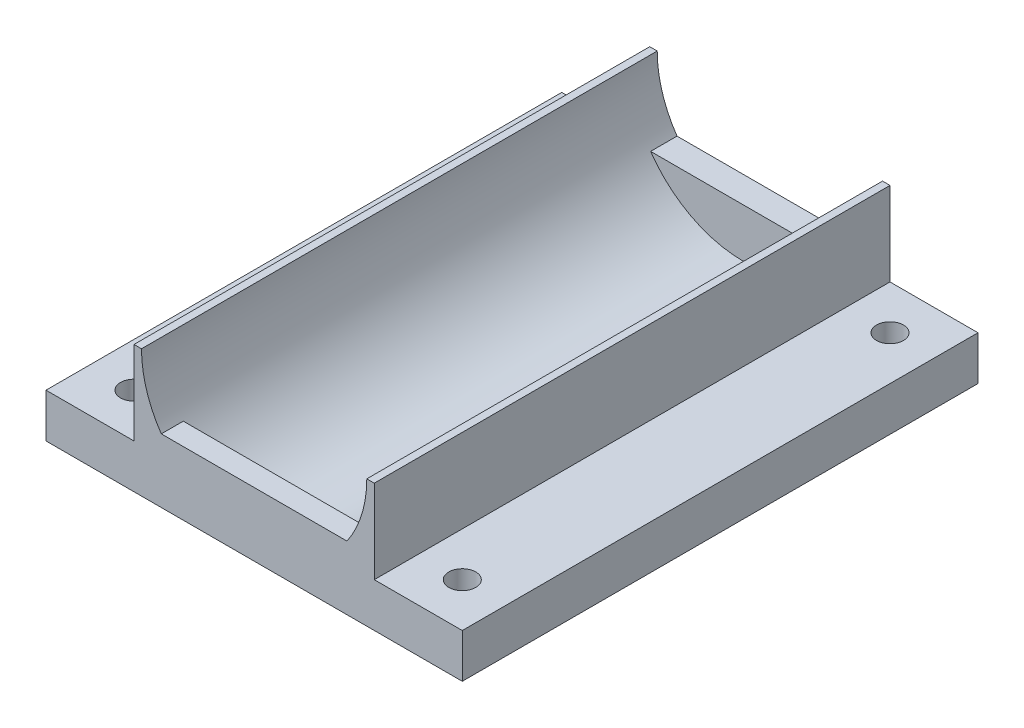
ISO-10303-21;
HEADER;
FILE_DESCRIPTION(('STEP AP214'),'2;1');
FILE_NAME('part.step','',(''),(''),'','','');
FILE_SCHEMA(('AUTOMOTIVE_DESIGN { 1 0 10303 214 1 1 1 1 }'));
ENDSEC;
DATA;
#1=APPLICATION_CONTEXT('core data for automotive mechanical design processes');
#2=APPLICATION_PROTOCOL_DEFINITION('international standard','automotive_design',2000,#1);
#3=PRODUCT_CONTEXT('',#1,'mechanical');
#4=PRODUCT('Part','Part','',(#3));
#5=PRODUCT_RELATED_PRODUCT_CATEGORY('part','',(#4));
#6=PRODUCT_DEFINITION_FORMATION('','',#4);
#7=PRODUCT_DEFINITION_CONTEXT('part definition',#1,'design');
#8=PRODUCT_DEFINITION('design','',#6,#7);
#9=PRODUCT_DEFINITION_SHAPE('','',#8);
#10=(LENGTH_UNIT() NAMED_UNIT(*) SI_UNIT(.MILLI.,.METRE.));
#11=(NAMED_UNIT(*) PLANE_ANGLE_UNIT() SI_UNIT($,.RADIAN.));
#12=(NAMED_UNIT(*) SI_UNIT($,.STERADIAN.) SOLID_ANGLE_UNIT());
#13=UNCERTAINTY_MEASURE_WITH_UNIT(LENGTH_MEASURE(1.E-05),#10,'distance_accuracy_value','');
#14=(GEOMETRIC_REPRESENTATION_CONTEXT(3) GLOBAL_UNCERTAINTY_ASSIGNED_CONTEXT((#13)) GLOBAL_UNIT_ASSIGNED_CONTEXT((#10,
#11,#12)) REPRESENTATION_CONTEXT('',''));
#15=CARTESIAN_POINT('',(0.,0.,0.));
#16=DIRECTION('',(0.,0.,1.));
#17=DIRECTION('',(1.,0.,0.));
#18=AXIS2_PLACEMENT_3D('',#15,#16,#17);
#19=CARTESIAN_POINT('',(0.,14.5,0.));
#20=DIRECTION('',(0.,1.,0.));
#21=DIRECTION('',(0.,0.,1.));
#22=AXIS2_PLACEMENT_3D('',#19,#20,#21);
#23=PLANE('',#22);
#24=DIRECTION('',(0.,0.,1.));
#25=VECTOR('',#24,1.);
#26=CARTESIAN_POINT('',(0.85,14.5,-58.6));
#27=LINE('',#26,#25);
#28=CARTESIAN_POINT('',(0.85,14.5,-58.6));
#29=VERTEX_POINT('',#28);
#30=CARTESIAN_POINT('',(0.85,14.5,0.));
#31=VERTEX_POINT('',#30);
#32=EDGE_CURVE('E284',#29,#31,#27,.T.);
#33=ORIENTED_EDGE('',*,*,#32,.F.);
#34=DIRECTION('',(1.,0.,0.));
#35=VECTOR('',#34,1.);
#36=CARTESIAN_POINT('',(0.,14.5,-58.6));
#37=LINE('',#36,#35);
#38=CARTESIAN_POINT('',(0.,14.5,-58.6));
#39=VERTEX_POINT('',#38);
#40=EDGE_CURVE('E244',#39,#29,#37,.T.);
#41=ORIENTED_EDGE('',*,*,#40,.F.);
#42=DIRECTION('',(0.,0.,-1.));
#43=VECTOR('',#42,1.);
#44=CARTESIAN_POINT('',(0.,14.5,0.));
#45=LINE('',#44,#43);
#46=CARTESIAN_POINT('',(0.,14.5,0.));
#47=VERTEX_POINT('',#46);
#48=EDGE_CURVE('E248',#47,#39,#45,.T.);
#49=ORIENTED_EDGE('',*,*,#48,.F.);
#50=DIRECTION('',(1.,0.,0.));
#51=VECTOR('',#50,1.);
#52=CARTESIAN_POINT('',(0.,14.5,0.));
#53=LINE('',#52,#51);
#54=EDGE_CURVE('E254',#47,#31,#53,.T.);
#55=ORIENTED_EDGE('',*,*,#54,.T.);
#56=EDGE_LOOP('',(#33,#41,#49,#55));
#57=FACE_BOUND('',#56,.T.);
#58=ADVANCED_FACE('F41',(#57),#23,.T.);
#59=CARTESIAN_POINT('',(0.,14.5,-58.6));
#60=DIRECTION('',(0.,0.,-1.));
#61=DIRECTION('',(-1.,0.,0.));
#62=AXIS2_PLACEMENT_3D('',#59,#60,#61);
#63=PLANE('',#62);
#64=DIRECTION('',(0.,-1.,0.));
#65=VECTOR('',#64,1.);
#66=CARTESIAN_POINT('',(27.3,14.5,-58.6));
#67=LINE('',#66,#65);
#68=CARTESIAN_POINT('',(27.3,14.5,-58.6));
#69=VERTEX_POINT('',#68);
#70=CARTESIAN_POINT('',(27.3,5.,-58.6));
#71=VERTEX_POINT('',#70);
#72=EDGE_CURVE('E262',#69,#71,#67,.T.);
#73=ORIENTED_EDGE('',*,*,#72,.T.);
#74=DIRECTION('',(-1.,0.,0.));
#75=VECTOR('',#74,1.);
#76=CARTESIAN_POINT('',(0.,5.,-58.6));
#77=LINE('',#76,#75);
#78=CARTESIAN_POINT('',(37.3,5.,-58.6));
#79=VERTEX_POINT('',#78);
#80=EDGE_CURVE('E65',#79,#71,#77,.T.);
#81=ORIENTED_EDGE('',*,*,#80,.F.);
#82=DIRECTION('',(0.,-1.,0.));
#83=VECTOR('',#82,1.);
#84=CARTESIAN_POINT('',(37.3,5.,-58.6));
#85=LINE('',#84,#83);
#86=CARTESIAN_POINT('',(37.3,0.,-58.6));
#87=VERTEX_POINT('',#86);
#88=EDGE_CURVE('E216',#79,#87,#85,.T.);
#89=ORIENTED_EDGE('',*,*,#88,.T.);
#90=DIRECTION('',(1.,0.,0.));
#91=VECTOR('',#90,1.);
#92=CARTESIAN_POINT('',(0.,0.,-58.6));
#93=LINE('',#92,#91);
#94=CARTESIAN_POINT('',(-9.99999999999999,0.,-58.6));
#95=VERTEX_POINT('',#94);
#96=EDGE_CURVE('E238',#95,#87,#93,.T.);
#97=ORIENTED_EDGE('',*,*,#96,.F.);
#98=DIRECTION('',(0.,-1.,0.));
#99=VECTOR('',#98,1.);
#100=CARTESIAN_POINT('',(-9.99999999999999,5.,-58.6));
#101=LINE('',#100,#99);
#102=CARTESIAN_POINT('',(-9.99999999999999,5.,-58.6));
#103=VERTEX_POINT('',#102);
#104=EDGE_CURVE('E174',#103,#95,#101,.T.);
#105=ORIENTED_EDGE('',*,*,#104,.F.);
#106=DIRECTION('',(1.,0.,0.));
#107=VECTOR('',#106,1.);
#108=CARTESIAN_POINT('',(0.,5.,-58.6));
#109=LINE('',#108,#107);
#110=CARTESIAN_POINT('',(0.,5.,-58.6));
#111=VERTEX_POINT('',#110);
#112=EDGE_CURVE('E163',#103,#111,#109,.T.);
#113=ORIENTED_EDGE('',*,*,#112,.T.);
#114=DIRECTION('',(0.,-1.,0.));
#115=VECTOR('',#114,1.);
#116=CARTESIAN_POINT('',(0.,14.5,-58.6));
#117=LINE('',#116,#115);
#118=EDGE_CURVE('E277',#39,#111,#117,.T.);
#119=ORIENTED_EDGE('',*,*,#118,.F.);
#120=ORIENTED_EDGE('',*,*,#40,.T.);
#121=CARTESIAN_POINT('',(13.65,14.5,-58.6));
#122=DIRECTION('',(0.,0.,1.));
#123=DIRECTION('',(1.,0.,0.));
#124=AXIS2_PLACEMENT_3D('',#121,#122,#123);
#125=CIRCLE('',#124,12.8);
#126=CARTESIAN_POINT('',(3.10118490066301,7.25,-58.6));
#127=VERTEX_POINT('',#126);
#128=EDGE_CURVE('E234',#29,#127,#125,.T.);
#129=ORIENTED_EDGE('',*,*,#128,.T.);
#130=DIRECTION('',(1.,0.,0.));
#131=VECTOR('',#130,1.);
#132=CARTESIAN_POINT('',(27.3,7.25,-58.6));
#133=LINE('',#132,#131);
#134=CARTESIAN_POINT('',(24.198815099337,7.25,-58.6));
#135=VERTEX_POINT('',#134);
#136=EDGE_CURVE('E224',#127,#135,#133,.T.);
#137=ORIENTED_EDGE('',*,*,#136,.T.);
#138=CARTESIAN_POINT('',(26.45,14.5,-58.6));
#139=VERTEX_POINT('',#138);
#140=EDGE_CURVE('E239',#135,#139,#125,.T.);
#141=ORIENTED_EDGE('',*,*,#140,.T.);
#142=EDGE_CURVE('E249',#139,#69,#37,.T.);
#143=ORIENTED_EDGE('',*,*,#142,.T.);
#144=EDGE_LOOP('',(#73,#81,#89,#97,#105,#113,#119,#120,#129,#137,#141,#143));
#145=FACE_BOUND('',#144,.T.);
#146=ADVANCED_FACE('F43',(#145),#63,.T.);
#147=CARTESIAN_POINT('',(0.,14.5,0.));
#148=DIRECTION('',(-1.,0.,0.));
#149=DIRECTION('',(0.,0.,1.));
#150=AXIS2_PLACEMENT_3D('',#147,#148,#149);
#151=PLANE('',#150);
#152=DIRECTION('',(0.,0.,-1.));
#153=VECTOR('',#152,1.);
#154=CARTESIAN_POINT('',(0.,5.,0.));
#155=LINE('',#154,#153);
#156=CARTESIAN_POINT('',(0.,5.,0.));
#157=VERTEX_POINT('',#156);
#158=EDGE_CURVE('E57',#157,#111,#155,.T.);
#159=ORIENTED_EDGE('',*,*,#158,.F.);
#160=DIRECTION('',(0.,-1.,0.));
#161=VECTOR('',#160,1.);
#162=CARTESIAN_POINT('',(0.,14.5,0.));
#163=LINE('',#162,#161);
#164=EDGE_CURVE('E153',#47,#157,#163,.T.);
#165=ORIENTED_EDGE('',*,*,#164,.F.);
#166=ORIENTED_EDGE('',*,*,#48,.T.);
#167=ORIENTED_EDGE('',*,*,#118,.T.);
#168=EDGE_LOOP('',(#159,#165,#166,#167));
#169=FACE_BOUND('',#168,.T.);
#170=ADVANCED_FACE('F350',(#169),#151,.T.);
#171=CARTESIAN_POINT('',(0.,14.5,0.));
#172=DIRECTION('',(0.,0.,-1.));
#173=DIRECTION('',(-1.,0.,0.));
#174=AXIS2_PLACEMENT_3D('',#171,#172,#173);
#175=PLANE('',#174);
#176=CARTESIAN_POINT('',(13.65,14.5,0.));
#177=DIRECTION('',(0.,0.,1.));
#178=DIRECTION('',(1.,0.,0.));
#179=AXIS2_PLACEMENT_3D('',#176,#177,#178);
#180=CIRCLE('',#179,12.8);
#181=CARTESIAN_POINT('',(24.198815099337,7.25,0.));
#182=VERTEX_POINT('',#181);
#183=CARTESIAN_POINT('',(26.45,14.5,0.));
#184=VERTEX_POINT('',#183);
#185=EDGE_CURVE('E231',#182,#184,#180,.T.);
#186=ORIENTED_EDGE('',*,*,#185,.F.);
#187=DIRECTION('',(1.,0.,0.));
#188=VECTOR('',#187,1.);
#189=CARTESIAN_POINT('',(27.3,7.25,0.));
#190=LINE('',#189,#188);
#191=CARTESIAN_POINT('',(3.10118490066301,7.25,0.));
#192=VERTEX_POINT('',#191);
#193=EDGE_CURVE('E221',#192,#182,#190,.T.);
#194=ORIENTED_EDGE('',*,*,#193,.F.);
#195=EDGE_CURVE('E240',#31,#192,#180,.T.);
#196=ORIENTED_EDGE('',*,*,#195,.F.);
#197=ORIENTED_EDGE('',*,*,#54,.F.);
#198=ORIENTED_EDGE('',*,*,#164,.T.);
#199=DIRECTION('',(1.,0.,0.));
#200=VECTOR('',#199,1.);
#201=CARTESIAN_POINT('',(0.,5.,0.));
#202=LINE('',#201,#200);
#203=CARTESIAN_POINT('',(-9.99999999999999,5.,0.));
#204=VERTEX_POINT('',#203);
#205=EDGE_CURVE('E145',#204,#157,#202,.T.);
#206=ORIENTED_EDGE('',*,*,#205,.F.);
#207=DIRECTION('',(0.,-1.,0.));
#208=VECTOR('',#207,1.);
#209=CARTESIAN_POINT('',(-9.99999999999999,5.,0.));
#210=LINE('',#209,#208);
#211=CARTESIAN_POINT('',(-9.99999999999999,0.,0.));
#212=VERTEX_POINT('',#211);
#213=EDGE_CURVE('E150',#204,#212,#210,.T.);
#214=ORIENTED_EDGE('',*,*,#213,.T.);
#215=DIRECTION('',(1.,0.,0.));
#216=VECTOR('',#215,1.);
#217=CARTESIAN_POINT('',(0.,0.,0.));
#218=LINE('',#217,#216);
#219=CARTESIAN_POINT('',(37.3,0.,0.));
#220=VERTEX_POINT('',#219);
#221=EDGE_CURVE('E265',#212,#220,#218,.T.);
#222=ORIENTED_EDGE('',*,*,#221,.T.);
#223=DIRECTION('',(0.,-1.,0.));
#224=VECTOR('',#223,1.);
#225=CARTESIAN_POINT('',(37.3,5.,0.));
#226=LINE('',#225,#224);
#227=CARTESIAN_POINT('',(37.3,5.,0.));
#228=VERTEX_POINT('',#227);
#229=EDGE_CURVE('E205',#228,#220,#226,.T.);
#230=ORIENTED_EDGE('',*,*,#229,.F.);
#231=DIRECTION('',(1.,0.,0.));
#232=VECTOR('',#231,1.);
#233=CARTESIAN_POINT('',(0.,5.,0.));
#234=LINE('',#233,#232);
#235=CARTESIAN_POINT('',(27.3,5.,0.));
#236=VERTEX_POINT('',#235);
#237=EDGE_CURVE('E195',#236,#228,#234,.T.);
#238=ORIENTED_EDGE('',*,*,#237,.F.);
#239=DIRECTION('',(0.,-1.,0.));
#240=VECTOR('',#239,1.);
#241=CARTESIAN_POINT('',(27.3,14.5,0.));
#242=LINE('',#241,#240);
#243=CARTESIAN_POINT('',(27.3,14.5,0.));
#244=VERTEX_POINT('',#243);
#245=EDGE_CURVE('E271',#244,#236,#242,.T.);
#246=ORIENTED_EDGE('',*,*,#245,.F.);
#247=EDGE_CURVE('E253',#184,#244,#53,.T.);
#248=ORIENTED_EDGE('',*,*,#247,.F.);
#249=EDGE_LOOP('',(#186,#194,#196,#197,#198,#206,#214,#222,#230,#238,#246,#248));
#250=FACE_BOUND('',#249,.T.);
#251=ADVANCED_FACE('F148',(#250),#175,.F.);
#252=CARTESIAN_POINT('',(27.3,14.5,0.));
#253=DIRECTION('',(-1.,0.,0.));
#254=DIRECTION('',(0.,0.,1.));
#255=AXIS2_PLACEMENT_3D('',#252,#253,#254);
#256=PLANE('',#255);
#257=ORIENTED_EDGE('',*,*,#245,.T.);
#258=DIRECTION('',(0.,0.,-1.));
#259=VECTOR('',#258,1.);
#260=CARTESIAN_POINT('',(27.3,5.,0.));
#261=LINE('',#260,#259);
#262=EDGE_CURVE('E192',#236,#71,#261,.T.);
#263=ORIENTED_EDGE('',*,*,#262,.T.);
#264=ORIENTED_EDGE('',*,*,#72,.F.);
#265=DIRECTION('',(0.,0.,-1.));
#266=VECTOR('',#265,1.);
#267=CARTESIAN_POINT('',(27.3,14.5,0.));
#268=LINE('',#267,#266);
#269=EDGE_CURVE('E258',#244,#69,#268,.T.);
#270=ORIENTED_EDGE('',*,*,#269,.F.);
#271=EDGE_LOOP('',(#257,#263,#264,#270));
#272=FACE_BOUND('',#271,.T.);
#273=ADVANCED_FACE('F324',(#272),#256,.F.);
#274=DIRECTION('',(0.,0.,1.));
#275=VECTOR('',#274,1.);
#276=CARTESIAN_POINT('',(26.45,14.5,-58.6));
#277=LINE('',#276,#275);
#278=EDGE_CURVE('E280',#184,#139,#277,.F.);
#279=ORIENTED_EDGE('',*,*,#278,.F.);
#280=ORIENTED_EDGE('',*,*,#247,.T.);
#281=ORIENTED_EDGE('',*,*,#269,.T.);
#282=ORIENTED_EDGE('',*,*,#142,.F.);
#283=EDGE_LOOP('',(#279,#280,#281,#282));
#284=FACE_BOUND('',#283,.T.);
#285=ADVANCED_FACE('F318',(#284),#23,.T.);
#286=CARTESIAN_POINT('',(0.,0.,0.));
#287=DIRECTION('',(0.,1.,0.));
#288=DIRECTION('',(0.,0.,1.));
#289=AXIS2_PLACEMENT_3D('',#286,#287,#288);
#290=PLANE('',#289);
#291=ORIENTED_EDGE('',*,*,#96,.T.);
#292=DIRECTION('',(0.,0.,1.));
#293=VECTOR('',#292,1.);
#294=CARTESIAN_POINT('',(37.3,0.,0.));
#295=LINE('',#294,#293);
#296=EDGE_CURVE('E173',#87,#220,#295,.T.);
#297=ORIENTED_EDGE('',*,*,#296,.T.);
#298=ORIENTED_EDGE('',*,*,#221,.F.);
#299=DIRECTION('',(0.,0.,1.));
#300=VECTOR('',#299,1.);
#301=CARTESIAN_POINT('',(-9.99999999999999,0.,0.));
#302=LINE('',#301,#300);
#303=EDGE_CURVE('E171',#95,#212,#302,.T.);
#304=ORIENTED_EDGE('',*,*,#303,.F.);
#305=EDGE_LOOP('',(#291,#297,#298,#304));
#306=FACE_BOUND('',#305,.T.);
#307=CARTESIAN_POINT('',(32.3,0.,-53.6));
#308=DIRECTION('',(0.,1.,0.));
#309=DIRECTION('',(0.,0.,1.));
#310=AXIS2_PLACEMENT_3D('',#307,#308,#309);
#311=CIRCLE('',#310,1.52999999999999);
#312=CARTESIAN_POINT('',(32.3,0.,-52.07));
#313=VERTEX_POINT('',#312);
#314=EDGE_CURVE('E179',#313,#313,#311,.T.);
#315=ORIENTED_EDGE('',*,*,#314,.T.);
#316=EDGE_LOOP('',(#315));
#317=FACE_BOUND('',#316,.T.);
#318=CARTESIAN_POINT('',(32.3,0.,-5.));
#319=DIRECTION('',(0.,1.,0.));
#320=DIRECTION('',(0.,0.,1.));
#321=AXIS2_PLACEMENT_3D('',#318,#319,#320);
#322=CIRCLE('',#321,1.52999999999999);
#323=CARTESIAN_POINT('',(32.3,0.,-3.47));
#324=VERTEX_POINT('',#323);
#325=EDGE_CURVE('E189',#324,#324,#322,.F.);
#326=ORIENTED_EDGE('',*,*,#325,.F.);
#327=EDGE_LOOP('',(#326));
#328=FACE_BOUND('',#327,.T.);
#329=CARTESIAN_POINT('',(-4.99999999999999,0.,-4.99999999999999));
#330=DIRECTION('',(0.,1.,0.));
#331=DIRECTION('',(0.,0.,1.));
#332=AXIS2_PLACEMENT_3D('',#329,#330,#331);
#333=CIRCLE('',#332,1.52999999999999);
#334=CARTESIAN_POINT('',(-4.99999999999999,0.,-3.47));
#335=VERTEX_POINT('',#334);
#336=EDGE_CURVE('E490',#335,#335,#333,.T.);
#337=ORIENTED_EDGE('',*,*,#336,.T.);
#338=EDGE_LOOP('',(#337));
#339=FACE_BOUND('',#338,.T.);
#340=CARTESIAN_POINT('',(-4.99999999999999,0.,-53.6));
#341=DIRECTION('',(0.,1.,0.));
#342=DIRECTION('',(0.,0.,1.));
#343=AXIS2_PLACEMENT_3D('',#340,#341,#342);
#344=CIRCLE('',#343,1.52999999999999);
#345=CARTESIAN_POINT('',(-4.99999999999999,0.,-52.07));
#346=VERTEX_POINT('',#345);
#347=EDGE_CURVE('E167',#346,#346,#344,.F.);
#348=ORIENTED_EDGE('',*,*,#347,.F.);
#349=EDGE_LOOP('',(#348));
#350=FACE_BOUND('',#349,.T.);
#351=ADVANCED_FACE('F355',(#306,#317,#328,#339,#350),#290,.F.);
#352=CARTESIAN_POINT('',(13.65,14.5,-58.6));
#353=DIRECTION('',(0.,0.,1.));
#354=DIRECTION('',(1.,0.,0.));
#355=AXIS2_PLACEMENT_3D('',#352,#353,#354);
#356=CYLINDRICAL_SURFACE('',#355,12.8);
#357=ORIENTED_EDGE('',*,*,#195,.T.);
#358=DIRECTION('',(0.,0.,1.));
#359=VECTOR('',#358,1.);
#360=CARTESIAN_POINT('',(3.10118490066301,7.25,-58.6));
#361=LINE('',#360,#359);
#362=CARTESIAN_POINT('',(3.10118490066301,7.25,-2.5));
#363=VERTEX_POINT('',#362);
#364=EDGE_CURVE('E11',#192,#363,#361,.F.);
#365=ORIENTED_EDGE('',*,*,#364,.T.);
#366=CARTESIAN_POINT('',(13.65,14.5,-2.5));
#367=DIRECTION('',(0.,0.,-1.));
#368=DIRECTION('',(-1.,0.,0.));
#369=AXIS2_PLACEMENT_3D('',#366,#367,#368);
#370=CIRCLE('',#369,12.8);
#371=CARTESIAN_POINT('',(24.198815099337,7.25,-2.5));
#372=VERTEX_POINT('',#371);
#373=EDGE_CURVE('E298',#363,#372,#370,.F.);
#374=ORIENTED_EDGE('',*,*,#373,.T.);
#375=DIRECTION('',(0.,0.,1.));
#376=VECTOR('',#375,1.);
#377=CARTESIAN_POINT('',(24.198815099337,7.25,-58.6));
#378=LINE('',#377,#376);
#379=EDGE_CURVE('E50',#372,#182,#378,.T.);
#380=ORIENTED_EDGE('',*,*,#379,.T.);
#381=ORIENTED_EDGE('',*,*,#185,.T.);
#382=ORIENTED_EDGE('',*,*,#278,.T.);
#383=ORIENTED_EDGE('',*,*,#140,.F.);
#384=DIRECTION('',(0.,0.,1.));
#385=VECTOR('',#384,1.);
#386=CARTESIAN_POINT('',(24.198815099337,7.25,-58.6));
#387=LINE('',#386,#385);
#388=CARTESIAN_POINT('',(24.198815099337,7.25,-55.6));
#389=VERTEX_POINT('',#388);
#390=EDGE_CURVE('E290',#135,#389,#387,.T.);
#391=ORIENTED_EDGE('',*,*,#390,.T.);
#392=CARTESIAN_POINT('',(13.65,14.5,-55.6));
#393=DIRECTION('',(0.,0.,-1.));
#394=DIRECTION('',(-1.,0.,0.));
#395=AXIS2_PLACEMENT_3D('',#392,#393,#394);
#396=CIRCLE('',#395,12.8);
#397=CARTESIAN_POINT('',(3.10118490066301,7.25,-55.6));
#398=VERTEX_POINT('',#397);
#399=EDGE_CURVE('E287',#398,#389,#396,.F.);
#400=ORIENTED_EDGE('',*,*,#399,.F.);
#401=DIRECTION('',(0.,0.,1.));
#402=VECTOR('',#401,1.);
#403=CARTESIAN_POINT('',(3.10118490066301,7.25,-58.6));
#404=LINE('',#403,#402);
#405=EDGE_CURVE('E294',#398,#127,#404,.F.);
#406=ORIENTED_EDGE('',*,*,#405,.T.);
#407=ORIENTED_EDGE('',*,*,#128,.F.);
#408=ORIENTED_EDGE('',*,*,#32,.T.);
#409=EDGE_LOOP('',(#357,#365,#374,#380,#381,#382,#383,#391,#400,#406,#407,#408));
#410=FACE_BOUND('',#409,.T.);
#411=ADVANCED_FACE('F305',(#410),#356,.F.);
#412=CARTESIAN_POINT('',(27.3,7.25,-55.6));
#413=DIRECTION('',(0.,1.,0.));
#414=DIRECTION('',(0.,0.,1.));
#415=AXIS2_PLACEMENT_3D('',#412,#413,#414);
#416=PLANE('',#415);
#417=ORIENTED_EDGE('',*,*,#405,.F.);
#418=DIRECTION('',(1.,0.,0.));
#419=VECTOR('',#418,1.);
#420=CARTESIAN_POINT('',(27.3,7.25,-55.6));
#421=LINE('',#420,#419);
#422=EDGE_CURVE('E227',#398,#389,#421,.T.);
#423=ORIENTED_EDGE('',*,*,#422,.T.);
#424=ORIENTED_EDGE('',*,*,#390,.F.);
#425=ORIENTED_EDGE('',*,*,#136,.F.);
#426=EDGE_LOOP('',(#417,#423,#424,#425));
#427=FACE_BOUND('',#426,.T.);
#428=ADVANCED_FACE('F330',(#427),#416,.T.);
#429=CARTESIAN_POINT('',(0.,0.,-55.6));
#430=DIRECTION('',(0.,0.,-1.));
#431=DIRECTION('',(-1.,0.,0.));
#432=AXIS2_PLACEMENT_3D('',#429,#430,#431);
#433=PLANE('',#432);
#434=ORIENTED_EDGE('',*,*,#422,.F.);
#435=ORIENTED_EDGE('',*,*,#399,.T.);
#436=EDGE_LOOP('',(#434,#435));
#437=FACE_BOUND('',#436,.T.);
#438=ADVANCED_FACE('F333',(#437),#433,.F.);
#439=CARTESIAN_POINT('',(27.3,7.25,0.));
#440=DIRECTION('',(0.,1.,0.));
#441=DIRECTION('',(0.,0.,1.));
#442=AXIS2_PLACEMENT_3D('',#439,#440,#441);
#443=PLANE('',#442);
#444=ORIENTED_EDGE('',*,*,#364,.F.);
#445=ORIENTED_EDGE('',*,*,#193,.T.);
#446=ORIENTED_EDGE('',*,*,#379,.F.);
#447=DIRECTION('',(1.,0.,0.));
#448=VECTOR('',#447,1.);
#449=CARTESIAN_POINT('',(27.3,7.25,-2.5));
#450=LINE('',#449,#448);
#451=EDGE_CURVE('E220',#363,#372,#450,.T.);
#452=ORIENTED_EDGE('',*,*,#451,.F.);
#453=EDGE_LOOP('',(#444,#445,#446,#452));
#454=FACE_BOUND('',#453,.T.);
#455=ADVANCED_FACE('F335',(#454),#443,.T.);
#456=CARTESIAN_POINT('',(0.,0.,-2.5));
#457=DIRECTION('',(0.,0.,-1.));
#458=DIRECTION('',(-1.,0.,0.));
#459=AXIS2_PLACEMENT_3D('',#456,#457,#458);
#460=PLANE('',#459);
#461=ORIENTED_EDGE('',*,*,#373,.F.);
#462=ORIENTED_EDGE('',*,*,#451,.T.);
#463=EDGE_LOOP('',(#461,#462));
#464=FACE_BOUND('',#463,.T.);
#465=ADVANCED_FACE('F341',(#464),#460,.T.);
#466=CARTESIAN_POINT('',(37.3,5.,0.));
#467=DIRECTION('',(1.,0.,0.));
#468=DIRECTION('',(0.,0.,-1.));
#469=AXIS2_PLACEMENT_3D('',#466,#467,#468);
#470=PLANE('',#469);
#471=ORIENTED_EDGE('',*,*,#296,.F.);
#472=ORIENTED_EDGE('',*,*,#88,.F.);
#473=DIRECTION('',(0.,0.,1.));
#474=VECTOR('',#473,1.);
#475=CARTESIAN_POINT('',(37.3,5.,0.));
#476=LINE('',#475,#474);
#477=EDGE_CURVE('E185',#79,#228,#476,.T.);
#478=ORIENTED_EDGE('',*,*,#477,.T.);
#479=ORIENTED_EDGE('',*,*,#229,.T.);
#480=EDGE_LOOP('',(#471,#472,#478,#479));
#481=FACE_BOUND('',#480,.T.);
#482=ADVANCED_FACE('F396',(#481),#470,.T.);
#483=CARTESIAN_POINT('',(32.3,5.,-53.6));
#484=DIRECTION('',(0.,-1.,0.));
#485=DIRECTION('',(0.,0.,-1.));
#486=AXIS2_PLACEMENT_3D('',#483,#484,#485);
#487=CYLINDRICAL_SURFACE('',#486,1.52999999999999);
#488=CARTESIAN_POINT('',(32.3,5.,-53.6));
#489=DIRECTION('',(0.,1.,0.));
#490=DIRECTION('',(0.,0.,1.));
#491=AXIS2_PLACEMENT_3D('',#488,#489,#490);
#492=CIRCLE('',#491,1.52999999999999);
#493=CARTESIAN_POINT('',(32.3,5.,-52.07));
#494=VERTEX_POINT('',#493);
#495=EDGE_CURVE('E198',#494,#494,#492,.T.);
#496=ORIENTED_EDGE('',*,*,#495,.T.);
#497=EDGE_LOOP('',(#496));
#498=FACE_BOUND('',#497,.T.);
#499=ORIENTED_EDGE('',*,*,#314,.F.);
#500=EDGE_LOOP('',(#499));
#501=FACE_BOUND('',#500,.T.);
#502=ADVANCED_FACE('F400',(#498,#501),#487,.F.);
#503=CARTESIAN_POINT('',(32.3,5.,-5.));
#504=DIRECTION('',(0.,-1.,0.));
#505=DIRECTION('',(0.,0.,-1.));
#506=AXIS2_PLACEMENT_3D('',#503,#504,#505);
#507=CYLINDRICAL_SURFACE('',#506,1.52999999999999);
#508=CARTESIAN_POINT('',(32.3,5.,-5.));
#509=DIRECTION('',(0.,1.,0.));
#510=DIRECTION('',(0.,0.,1.));
#511=AXIS2_PLACEMENT_3D('',#508,#509,#510);
#512=CIRCLE('',#511,1.52999999999999);
#513=CARTESIAN_POINT('',(32.3,5.,-3.47));
#514=VERTEX_POINT('',#513);
#515=EDGE_CURVE('E202',#514,#514,#512,.F.);
#516=ORIENTED_EDGE('',*,*,#515,.F.);
#517=EDGE_LOOP('',(#516));
#518=FACE_BOUND('',#517,.T.);
#519=ORIENTED_EDGE('',*,*,#325,.T.);
#520=EDGE_LOOP('',(#519));
#521=FACE_BOUND('',#520,.T.);
#522=ADVANCED_FACE('F411',(#518,#521),#507,.F.);
#523=CARTESIAN_POINT('',(0.,5.,0.));
#524=DIRECTION('',(0.,1.,0.));
#525=DIRECTION('',(0.,0.,1.));
#526=AXIS2_PLACEMENT_3D('',#523,#524,#525);
#527=PLANE('',#526);
#528=ORIENTED_EDGE('',*,*,#477,.F.);
#529=ORIENTED_EDGE('',*,*,#80,.T.);
#530=ORIENTED_EDGE('',*,*,#262,.F.);
#531=ORIENTED_EDGE('',*,*,#237,.T.);
#532=EDGE_LOOP('',(#528,#529,#530,#531));
#533=FACE_BOUND('',#532,.T.);
#534=ORIENTED_EDGE('',*,*,#495,.F.);
#535=EDGE_LOOP('',(#534));
#536=FACE_BOUND('',#535,.T.);
#537=ORIENTED_EDGE('',*,*,#515,.T.);
#538=EDGE_LOOP('',(#537));
#539=FACE_BOUND('',#538,.T.);
#540=ADVANCED_FACE('F421',(#533,#536,#539),#527,.T.);
#541=CARTESIAN_POINT('',(-9.99999999999999,5.,0.));
#542=DIRECTION('',(1.,0.,0.));
#543=DIRECTION('',(0.,0.,-1.));
#544=AXIS2_PLACEMENT_3D('',#541,#542,#543);
#545=PLANE('',#544);
#546=ORIENTED_EDGE('',*,*,#303,.T.);
#547=ORIENTED_EDGE('',*,*,#213,.F.);
#548=DIRECTION('',(0.,0.,1.));
#549=VECTOR('',#548,1.);
#550=CARTESIAN_POINT('',(-9.99999999999999,5.,0.));
#551=LINE('',#550,#549);
#552=EDGE_CURVE('E156',#103,#204,#551,.T.);
#553=ORIENTED_EDGE('',*,*,#552,.F.);
#554=ORIENTED_EDGE('',*,*,#104,.T.);
#555=EDGE_LOOP('',(#546,#547,#553,#554));
#556=FACE_BOUND('',#555,.T.);
#557=ADVANCED_FACE('F169',(#556),#545,.F.);
#558=CARTESIAN_POINT('',(-4.99999999999999,5.,-4.99999999999999));
#559=DIRECTION('',(0.,-1.,0.));
#560=DIRECTION('',(0.,0.,-1.));
#561=AXIS2_PLACEMENT_3D('',#558,#559,#560);
#562=CYLINDRICAL_SURFACE('',#561,1.52999999999999);
#563=CARTESIAN_POINT('',(-4.99999999999999,5.,-4.99999999999999));
#564=DIRECTION('',(0.,1.,0.));
#565=DIRECTION('',(0.,0.,1.));
#566=AXIS2_PLACEMENT_3D('',#563,#564,#565);
#567=CIRCLE('',#566,1.52999999999999);
#568=CARTESIAN_POINT('',(-4.99999999999999,5.,-3.47));
#569=VERTEX_POINT('',#568);
#570=EDGE_CURVE('E479',#569,#569,#567,.T.);
#571=ORIENTED_EDGE('',*,*,#570,.T.);
#572=EDGE_LOOP('',(#571));
#573=FACE_BOUND('',#572,.T.);
#574=ORIENTED_EDGE('',*,*,#336,.F.);
#575=EDGE_LOOP('',(#574));
#576=FACE_BOUND('',#575,.T.);
#577=ADVANCED_FACE('F439',(#573,#576),#562,.F.);
#578=CARTESIAN_POINT('',(-4.99999999999999,5.,-53.6));
#579=DIRECTION('',(0.,-1.,0.));
#580=DIRECTION('',(0.,0.,-1.));
#581=AXIS2_PLACEMENT_3D('',#578,#579,#580);
#582=CYLINDRICAL_SURFACE('',#581,1.52999999999999);
#583=CARTESIAN_POINT('',(-4.99999999999999,5.,-53.6));
#584=DIRECTION('',(0.,1.,0.));
#585=DIRECTION('',(0.,0.,1.));
#586=AXIS2_PLACEMENT_3D('',#583,#584,#585);
#587=CIRCLE('',#586,1.52999999999999);
#588=CARTESIAN_POINT('',(-4.99999999999999,5.,-52.07));
#589=VERTEX_POINT('',#588);
#590=EDGE_CURVE('E181',#589,#589,#587,.F.);
#591=ORIENTED_EDGE('',*,*,#590,.F.);
#592=EDGE_LOOP('',(#591));
#593=FACE_BOUND('',#592,.T.);
#594=ORIENTED_EDGE('',*,*,#347,.T.);
#595=EDGE_LOOP('',(#594));
#596=FACE_BOUND('',#595,.T.);
#597=ADVANCED_FACE('F448',(#593,#596),#582,.F.);
#598=CARTESIAN_POINT('',(0.,5.,0.));
#599=DIRECTION('',(0.,1.,0.));
#600=DIRECTION('',(0.,0.,1.));
#601=AXIS2_PLACEMENT_3D('',#598,#599,#600);
#602=PLANE('',#601);
#603=ORIENTED_EDGE('',*,*,#552,.T.);
#604=ORIENTED_EDGE('',*,*,#205,.T.);
#605=ORIENTED_EDGE('',*,*,#158,.T.);
#606=ORIENTED_EDGE('',*,*,#112,.F.);
#607=EDGE_LOOP('',(#603,#604,#605,#606));
#608=FACE_BOUND('',#607,.T.);
#609=ORIENTED_EDGE('',*,*,#570,.F.);
#610=EDGE_LOOP('',(#609));
#611=FACE_BOUND('',#610,.T.);
#612=ORIENTED_EDGE('',*,*,#590,.T.);
#613=EDGE_LOOP('',(#612));
#614=FACE_BOUND('',#613,.T.);
#615=ADVANCED_FACE('F160',(#608,#611,#614),#602,.T.);
#616=CLOSED_SHELL('',(#58,#146,#170,#251,#273,#285,#351,#411,#428,#438,#455,#465,#482,#502,#522,
#540,#557,#577,#597,#615));
#617=MANIFOLD_SOLID_BREP('B2',#616);
#618=ADVANCED_BREP_SHAPE_REPRESENTATION('',(#18,#617),#14);
#619=SHAPE_DEFINITION_REPRESENTATION(#9,#618);
ENDSEC;
END-ISO-10303-21;
